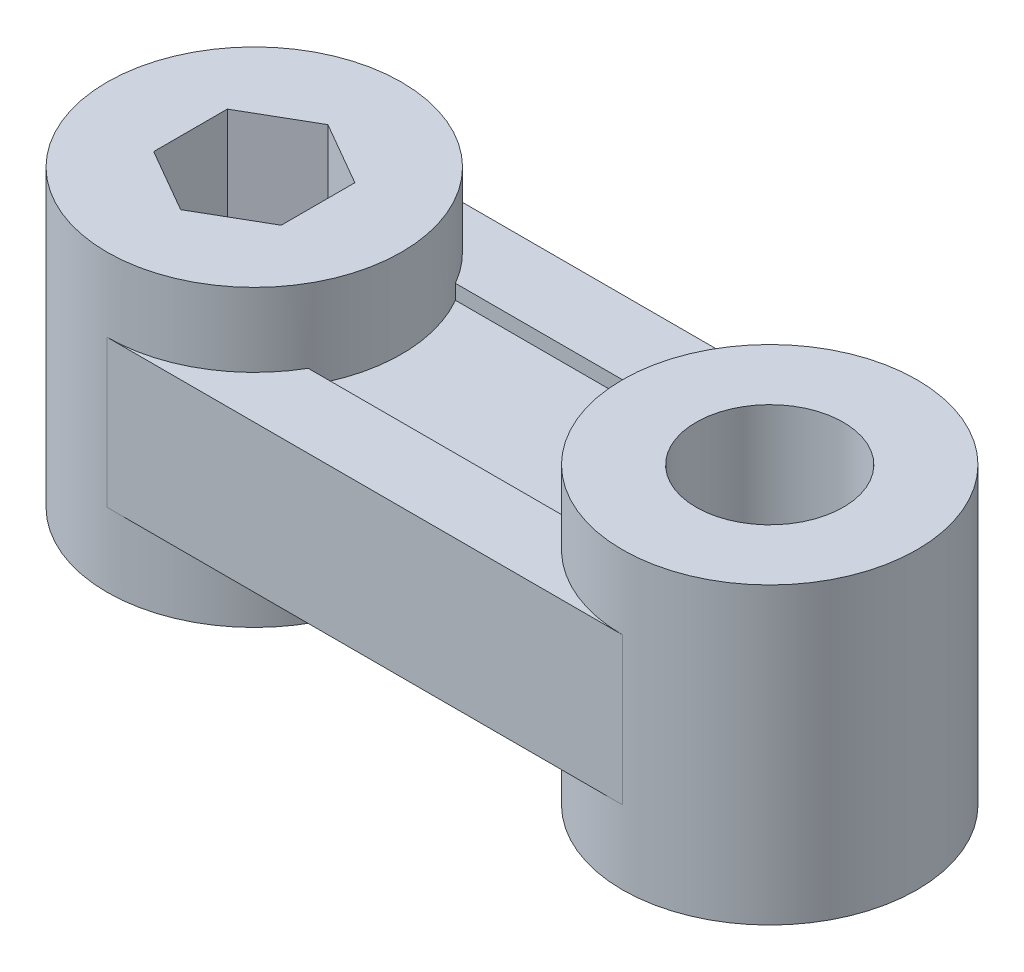
ISO-10303-21;
HEADER;
FILE_DESCRIPTION(('STEP AP214'),'2;1');
FILE_NAME('part.step','',(''),(''),'','','');
FILE_SCHEMA(('AUTOMOTIVE_DESIGN { 1 0 10303 214 1 1 1 1 }'));
ENDSEC;
DATA;
#1=APPLICATION_CONTEXT('core data for automotive mechanical design processes');
#2=APPLICATION_PROTOCOL_DEFINITION('international standard','automotive_design',2000,#1);
#3=PRODUCT_CONTEXT('',#1,'mechanical');
#4=PRODUCT('Part','Part','',(#3));
#5=PRODUCT_RELATED_PRODUCT_CATEGORY('part','',(#4));
#6=PRODUCT_DEFINITION_FORMATION('','',#4);
#7=PRODUCT_DEFINITION_CONTEXT('part definition',#1,'design');
#8=PRODUCT_DEFINITION('design','',#6,#7);
#9=PRODUCT_DEFINITION_SHAPE('','',#8);
#10=(LENGTH_UNIT() NAMED_UNIT(*) SI_UNIT(.MILLI.,.METRE.));
#11=(NAMED_UNIT(*) PLANE_ANGLE_UNIT() SI_UNIT($,.RADIAN.));
#12=(NAMED_UNIT(*) SI_UNIT($,.STERADIAN.) SOLID_ANGLE_UNIT());
#13=UNCERTAINTY_MEASURE_WITH_UNIT(LENGTH_MEASURE(1.E-05),#10,'distance_accuracy_value','');
#14=(GEOMETRIC_REPRESENTATION_CONTEXT(3) GLOBAL_UNCERTAINTY_ASSIGNED_CONTEXT((#13)) GLOBAL_UNIT_ASSIGNED_CONTEXT((#10,
#11,#12)) REPRESENTATION_CONTEXT('',''));
#15=CARTESIAN_POINT('',(0.,0.,0.));
#16=DIRECTION('',(0.,0.,1.));
#17=DIRECTION('',(1.,0.,0.));
#18=AXIS2_PLACEMENT_3D('',#15,#16,#17);
#19=CARTESIAN_POINT('',(0.,5.,0.));
#20=DIRECTION('',(0.,-1.,0.));
#21=DIRECTION('',(0.,0.,-1.));
#22=AXIS2_PLACEMENT_3D('',#19,#20,#21);
#23=PLANE('',#22);
#24=DIRECTION('',(1.,0.,0.));
#25=VECTOR('',#24,1.);
#26=CARTESIAN_POINT('',(0.,5.,-5.00000000000001));
#27=LINE('',#26,#25);
#28=CARTESIAN_POINT('',(8.66025403784439,5.,-5.));
#29=VERTEX_POINT('',#28);
#30=CARTESIAN_POINT('',(26.3397459621556,5.,-5.));
#31=VERTEX_POINT('',#30);
#32=EDGE_CURVE('E180',#29,#31,#27,.T.);
#33=ORIENTED_EDGE('',*,*,#32,.F.);
#34=CARTESIAN_POINT('',(0.,5.,0.));
#35=DIRECTION('',(0.,-1.,0.));
#36=DIRECTION('',(0.,0.,-1.));
#37=AXIS2_PLACEMENT_3D('',#34,#35,#36);
#38=CIRCLE('',#37,10.);
#39=CARTESIAN_POINT('',(0.,5.,-10.));
#40=VERTEX_POINT('',#39);
#41=EDGE_CURVE('E195',#40,#29,#38,.T.);
#42=ORIENTED_EDGE('',*,*,#41,.F.);
#43=DIRECTION('',(1.,0.,0.));
#44=VECTOR('',#43,1.);
#45=CARTESIAN_POINT('',(0.,5.,-10.));
#46=LINE('',#45,#44);
#47=CARTESIAN_POINT('',(35.,5.,-10.));
#48=VERTEX_POINT('',#47);
#49=EDGE_CURVE('E198',#40,#48,#46,.T.);
#50=ORIENTED_EDGE('',*,*,#49,.T.);
#51=CARTESIAN_POINT('',(35.,5.,0.));
#52=DIRECTION('',(0.,-1.,0.));
#53=DIRECTION('',(0.,0.,-1.));
#54=AXIS2_PLACEMENT_3D('',#51,#52,#53);
#55=CIRCLE('',#54,10.);
#56=EDGE_CURVE('E57',#31,#48,#55,.T.);
#57=ORIENTED_EDGE('',*,*,#56,.F.);
#58=EDGE_LOOP('',(#33,#42,#50,#57));
#59=FACE_BOUND('',#58,.T.);
#60=ADVANCED_FACE('F34',(#59),#23,.T.);
#61=CARTESIAN_POINT('',(0.,20.,10.));
#62=DIRECTION('',(0.,0.,-1.));
#63=DIRECTION('',(-1.,0.,0.));
#64=AXIS2_PLACEMENT_3D('',#61,#62,#63);
#65=PLANE('',#64);
#66=DIRECTION('',(-1.,0.,0.));
#67=VECTOR('',#66,1.);
#68=CARTESIAN_POINT('',(0.,5.,10.));
#69=LINE('',#68,#67);
#70=CARTESIAN_POINT('',(35.,5.,10.));
#71=VERTEX_POINT('',#70);
#72=CARTESIAN_POINT('',(0.,5.,10.));
#73=VERTEX_POINT('',#72);
#74=EDGE_CURVE('E201',#71,#73,#69,.T.);
#75=ORIENTED_EDGE('',*,*,#74,.F.);
#76=DIRECTION('',(0.,-1.,0.));
#77=VECTOR('',#76,1.);
#78=CARTESIAN_POINT('',(35.,20.,10.));
#79=LINE('',#78,#77);
#80=CARTESIAN_POINT('',(35.,15.,10.));
#81=VERTEX_POINT('',#80);
#82=EDGE_CURVE('E42',#81,#71,#79,.T.);
#83=ORIENTED_EDGE('',*,*,#82,.F.);
#84=DIRECTION('',(1.,0.,0.));
#85=VECTOR('',#84,1.);
#86=CARTESIAN_POINT('',(35.,15.,10.));
#87=LINE('',#86,#85);
#88=CARTESIAN_POINT('',(0.,15.,10.));
#89=VERTEX_POINT('',#88);
#90=EDGE_CURVE('E234',#89,#81,#87,.T.);
#91=ORIENTED_EDGE('',*,*,#90,.F.);
#92=DIRECTION('',(0.,-1.,0.));
#93=VECTOR('',#92,1.);
#94=CARTESIAN_POINT('',(0.,20.,10.));
#95=LINE('',#94,#93);
#96=EDGE_CURVE('E11',#89,#73,#95,.T.);
#97=ORIENTED_EDGE('',*,*,#96,.T.);
#98=EDGE_LOOP('',(#75,#83,#91,#97));
#99=FACE_BOUND('',#98,.T.);
#100=ADVANCED_FACE('F316',(#99),#65,.F.);
#101=CARTESIAN_POINT('',(0.,20.,-10.));
#102=DIRECTION('',(0.,0.,1.));
#103=DIRECTION('',(1.,0.,0.));
#104=AXIS2_PLACEMENT_3D('',#101,#102,#103);
#105=PLANE('',#104);
#106=ORIENTED_EDGE('',*,*,#49,.F.);
#107=DIRECTION('',(0.,-1.,0.));
#108=VECTOR('',#107,1.);
#109=CARTESIAN_POINT('',(0.,20.,-10.));
#110=LINE('',#109,#108);
#111=CARTESIAN_POINT('',(0.,15.,-10.));
#112=VERTEX_POINT('',#111);
#113=EDGE_CURVE('E303',#112,#40,#110,.T.);
#114=ORIENTED_EDGE('',*,*,#113,.F.);
#115=DIRECTION('',(-1.,0.,0.));
#116=VECTOR('',#115,1.);
#117=CARTESIAN_POINT('',(0.,15.,-10.));
#118=LINE('',#117,#116);
#119=CARTESIAN_POINT('',(35.,15.,-10.));
#120=VERTEX_POINT('',#119);
#121=EDGE_CURVE('E241',#120,#112,#118,.T.);
#122=ORIENTED_EDGE('',*,*,#121,.F.);
#123=DIRECTION('',(0.,-1.,0.));
#124=VECTOR('',#123,1.);
#125=CARTESIAN_POINT('',(35.,20.,-10.));
#126=LINE('',#125,#124);
#127=EDGE_CURVE('E310',#120,#48,#126,.T.);
#128=ORIENTED_EDGE('',*,*,#127,.T.);
#129=EDGE_LOOP('',(#106,#114,#122,#128));
#130=FACE_BOUND('',#129,.T.);
#131=ADVANCED_FACE('F332',(#130),#105,.F.);
#132=CARTESIAN_POINT('',(0.,0.,0.));
#133=DIRECTION('',(0.,1.,0.));
#134=DIRECTION('',(0.,0.,1.));
#135=AXIS2_PLACEMENT_3D('',#132,#133,#134);
#136=PLANE('',#135);
#137=DIRECTION('',(-0.866025403784439,0.,-0.5));
#138=VECTOR('',#137,1.);
#139=CARTESIAN_POINT('',(4.33012701892219,0.,-2.5));
#140=LINE('',#139,#138);
#141=CARTESIAN_POINT('',(4.33012701892219,0.,-2.5));
#142=VERTEX_POINT('',#141);
#143=CARTESIAN_POINT('',(0.,0.,-5.));
#144=VERTEX_POINT('',#143);
#145=EDGE_CURVE('E244',#142,#144,#140,.T.);
#146=ORIENTED_EDGE('',*,*,#145,.T.);
#147=DIRECTION('',(-0.866025403784439,0.,0.5));
#148=VECTOR('',#147,1.);
#149=CARTESIAN_POINT('',(0.,0.,-5.));
#150=LINE('',#149,#148);
#151=CARTESIAN_POINT('',(-4.33012701892219,0.,-2.5));
#152=VERTEX_POINT('',#151);
#153=EDGE_CURVE('E262',#144,#152,#150,.T.);
#154=ORIENTED_EDGE('',*,*,#153,.T.);
#155=DIRECTION('',(0.,0.,1.));
#156=VECTOR('',#155,1.);
#157=CARTESIAN_POINT('',(-4.33012701892219,0.,-2.5));
#158=LINE('',#157,#156);
#159=CARTESIAN_POINT('',(-4.33012701892219,0.,2.5));
#160=VERTEX_POINT('',#159);
#161=EDGE_CURVE('E265',#152,#160,#158,.T.);
#162=ORIENTED_EDGE('',*,*,#161,.T.);
#163=DIRECTION('',(0.866025403784439,0.,0.5));
#164=VECTOR('',#163,1.);
#165=CARTESIAN_POINT('',(-4.33012701892219,0.,2.5));
#166=LINE('',#165,#164);
#167=CARTESIAN_POINT('',(0.,0.,5.));
#168=VERTEX_POINT('',#167);
#169=EDGE_CURVE('E268',#160,#168,#166,.T.);
#170=ORIENTED_EDGE('',*,*,#169,.T.);
#171=DIRECTION('',(0.866025403784439,0.,-0.5));
#172=VECTOR('',#171,1.);
#173=CARTESIAN_POINT('',(0.,0.,5.));
#174=LINE('',#173,#172);
#175=CARTESIAN_POINT('',(4.33012701892219,0.,2.5));
#176=VERTEX_POINT('',#175);
#177=EDGE_CURVE('E271',#168,#176,#174,.T.);
#178=ORIENTED_EDGE('',*,*,#177,.T.);
#179=DIRECTION('',(0.,0.,-1.));
#180=VECTOR('',#179,1.);
#181=CARTESIAN_POINT('',(4.33012701892219,0.,2.5));
#182=LINE('',#181,#180);
#183=EDGE_CURVE('E248',#176,#142,#182,.T.);
#184=ORIENTED_EDGE('',*,*,#183,.T.);
#185=EDGE_LOOP('',(#146,#154,#162,#170,#178,#184));
#186=FACE_BOUND('',#185,.T.);
#187=CARTESIAN_POINT('',(0.,0.,0.));
#188=DIRECTION('',(0.,1.,0.));
#189=DIRECTION('',(0.,0.,1.));
#190=AXIS2_PLACEMENT_3D('',#187,#188,#189);
#191=CIRCLE('',#190,10.);
#192=CARTESIAN_POINT('',(0.,0.,10.));
#193=VERTEX_POINT('',#192);
#194=EDGE_CURVE('E293',#193,#193,#191,.T.);
#195=ORIENTED_EDGE('',*,*,#194,.F.);
#196=EDGE_LOOP('',(#195));
#197=FACE_BOUND('',#196,.T.);
#198=ADVANCED_FACE('F361',(#186,#197),#136,.F.);
#199=CARTESIAN_POINT('',(35.,0.,0.));
#200=DIRECTION('',(0.,1.,0.));
#201=DIRECTION('',(0.,0.,1.));
#202=AXIS2_PLACEMENT_3D('',#199,#200,#201);
#203=CIRCLE('',#202,5.);
#204=CARTESIAN_POINT('',(35.,0.,5.));
#205=VERTEX_POINT('',#204);
#206=EDGE_CURVE('E289',#205,#205,#203,.T.);
#207=ORIENTED_EDGE('',*,*,#206,.T.);
#208=EDGE_LOOP('',(#207));
#209=FACE_BOUND('',#208,.T.);
#210=CARTESIAN_POINT('',(35.,0.,0.));
#211=DIRECTION('',(0.,1.,0.));
#212=DIRECTION('',(0.,0.,1.));
#213=AXIS2_PLACEMENT_3D('',#210,#211,#212);
#214=CIRCLE('',#213,10.);
#215=CARTESIAN_POINT('',(35.,0.,10.));
#216=VERTEX_POINT('',#215);
#217=EDGE_CURVE('E300',#216,#216,#214,.T.);
#218=ORIENTED_EDGE('',*,*,#217,.F.);
#219=EDGE_LOOP('',(#218));
#220=FACE_BOUND('',#219,.T.);
#221=ADVANCED_FACE('F352',(#209,#220),#136,.F.);
#222=CARTESIAN_POINT('',(0.,15.,0.));
#223=DIRECTION('',(0.,1.,0.));
#224=DIRECTION('',(0.,0.,1.));
#225=AXIS2_PLACEMENT_3D('',#222,#223,#224);
#226=PLANE('',#225);
#227=DIRECTION('',(1.,0.,0.));
#228=VECTOR('',#227,1.);
#229=CARTESIAN_POINT('',(8.66025403784439,15.,5.));
#230=LINE('',#229,#228);
#231=CARTESIAN_POINT('',(8.66025403784439,15.,5.));
#232=VERTEX_POINT('',#231);
#233=CARTESIAN_POINT('',(26.3397459621556,15.,5.));
#234=VERTEX_POINT('',#233);
#235=EDGE_CURVE('E209',#232,#234,#230,.T.);
#236=ORIENTED_EDGE('',*,*,#235,.F.);
#237=CARTESIAN_POINT('',(0.,15.,0.));
#238=DIRECTION('',(0.,-1.,0.));
#239=DIRECTION('',(0.,0.,1.));
#240=AXIS2_PLACEMENT_3D('',#237,#238,#239);
#241=CIRCLE('',#240,10.);
#242=EDGE_CURVE('E225',#232,#89,#241,.T.);
#243=ORIENTED_EDGE('',*,*,#242,.T.);
#244=ORIENTED_EDGE('',*,*,#90,.T.);
#245=CARTESIAN_POINT('',(35.,15.,0.));
#246=DIRECTION('',(0.,-1.,0.));
#247=DIRECTION('',(0.,0.,1.));
#248=AXIS2_PLACEMENT_3D('',#245,#246,#247);
#249=CIRCLE('',#248,10.);
#250=EDGE_CURVE('E238',#81,#234,#249,.T.);
#251=ORIENTED_EDGE('',*,*,#250,.T.);
#252=EDGE_LOOP('',(#236,#243,#244,#251));
#253=FACE_BOUND('',#252,.T.);
#254=ADVANCED_FACE('F349',(#253),#226,.T.);
#255=CARTESIAN_POINT('',(0.,20.,0.));
#256=DIRECTION('',(0.,1.,0.));
#257=DIRECTION('',(0.,0.,1.));
#258=AXIS2_PLACEMENT_3D('',#255,#256,#257);
#259=PLANE('',#258);
#260=CARTESIAN_POINT('',(0.,20.,0.));
#261=DIRECTION('',(0.,1.,0.));
#262=DIRECTION('',(0.,0.,1.));
#263=AXIS2_PLACEMENT_3D('',#260,#261,#262);
#264=CIRCLE('',#263,10.);
#265=CARTESIAN_POINT('',(0.,20.,10.));
#266=VERTEX_POINT('',#265);
#267=EDGE_CURVE('E296',#266,#266,#264,.T.);
#268=ORIENTED_EDGE('',*,*,#267,.T.);
#269=EDGE_LOOP('',(#268));
#270=FACE_BOUND('',#269,.T.);
#271=DIRECTION('',(-0.866025403784439,0.,0.5));
#272=VECTOR('',#271,1.);
#273=CARTESIAN_POINT('',(0.,20.,-5.));
#274=LINE('',#273,#272);
#275=CARTESIAN_POINT('',(0.,20.,-5.));
#276=VERTEX_POINT('',#275);
#277=CARTESIAN_POINT('',(-4.33012701892219,20.,-2.5));
#278=VERTEX_POINT('',#277);
#279=EDGE_CURVE('E247',#276,#278,#274,.T.);
#280=ORIENTED_EDGE('',*,*,#279,.F.);
#281=DIRECTION('',(-0.866025403784439,0.,-0.5));
#282=VECTOR('',#281,1.);
#283=CARTESIAN_POINT('',(4.33012701892219,20.,-2.5));
#284=LINE('',#283,#282);
#285=CARTESIAN_POINT('',(4.33012701892219,20.,-2.5));
#286=VERTEX_POINT('',#285);
#287=EDGE_CURVE('E245',#286,#276,#284,.T.);
#288=ORIENTED_EDGE('',*,*,#287,.F.);
#289=DIRECTION('',(0.,0.,-1.));
#290=VECTOR('',#289,1.);
#291=CARTESIAN_POINT('',(4.33012701892219,20.,2.5));
#292=LINE('',#291,#290);
#293=CARTESIAN_POINT('',(4.33012701892219,20.,2.5));
#294=VERTEX_POINT('',#293);
#295=EDGE_CURVE('E257',#294,#286,#292,.T.);
#296=ORIENTED_EDGE('',*,*,#295,.F.);
#297=DIRECTION('',(0.866025403784439,0.,-0.5));
#298=VECTOR('',#297,1.);
#299=CARTESIAN_POINT('',(0.,20.,5.));
#300=LINE('',#299,#298);
#301=CARTESIAN_POINT('',(0.,20.,5.));
#302=VERTEX_POINT('',#301);
#303=EDGE_CURVE('E254',#302,#294,#300,.T.);
#304=ORIENTED_EDGE('',*,*,#303,.F.);
#305=DIRECTION('',(0.866025403784439,0.,0.5));
#306=VECTOR('',#305,1.);
#307=CARTESIAN_POINT('',(-4.33012701892219,20.,2.5));
#308=LINE('',#307,#306);
#309=CARTESIAN_POINT('',(-4.33012701892219,20.,2.5));
#310=VERTEX_POINT('',#309);
#311=EDGE_CURVE('E252',#310,#302,#308,.T.);
#312=ORIENTED_EDGE('',*,*,#311,.F.);
#313=DIRECTION('',(0.,0.,1.));
#314=VECTOR('',#313,1.);
#315=CARTESIAN_POINT('',(-4.33012701892219,20.,-2.5));
#316=LINE('',#315,#314);
#317=EDGE_CURVE('E250',#278,#310,#316,.T.);
#318=ORIENTED_EDGE('',*,*,#317,.F.);
#319=EDGE_LOOP('',(#280,#288,#296,#304,#312,#318));
#320=FACE_BOUND('',#319,.T.);
#321=ADVANCED_FACE('F351',(#270,#320),#259,.T.);
#322=CARTESIAN_POINT('',(35.,20.,0.));
#323=DIRECTION('',(0.,1.,0.));
#324=DIRECTION('',(0.,0.,1.));
#325=AXIS2_PLACEMENT_3D('',#322,#323,#324);
#326=CIRCLE('',#325,10.);
#327=CARTESIAN_POINT('',(35.,20.,10.));
#328=VERTEX_POINT('',#327);
#329=EDGE_CURVE('E299',#328,#328,#326,.T.);
#330=ORIENTED_EDGE('',*,*,#329,.T.);
#331=EDGE_LOOP('',(#330));
#332=FACE_BOUND('',#331,.T.);
#333=CARTESIAN_POINT('',(35.,20.,0.));
#334=DIRECTION('',(0.,1.,0.));
#335=DIRECTION('',(0.,0.,1.));
#336=AXIS2_PLACEMENT_3D('',#333,#334,#335);
#337=CIRCLE('',#336,5.);
#338=CARTESIAN_POINT('',(35.,20.,5.));
#339=VERTEX_POINT('',#338);
#340=EDGE_CURVE('E290',#339,#339,#337,.T.);
#341=ORIENTED_EDGE('',*,*,#340,.F.);
#342=EDGE_LOOP('',(#341));
#343=FACE_BOUND('',#342,.T.);
#344=ADVANCED_FACE('F358',(#332,#343),#259,.T.);
#345=CARTESIAN_POINT('',(0.,20.,0.));
#346=DIRECTION('',(0.,-1.,0.));
#347=DIRECTION('',(0.,0.,-1.));
#348=AXIS2_PLACEMENT_3D('',#345,#346,#347);
#349=CYLINDRICAL_SURFACE('',#348,10.);
#350=ORIENTED_EDGE('',*,*,#194,.T.);
#351=EDGE_LOOP('',(#350));
#352=FACE_BOUND('',#351,.T.);
#353=ORIENTED_EDGE('',*,*,#96,.F.);
#354=ORIENTED_EDGE('',*,*,#242,.F.);
#355=DIRECTION('',(0.,1.,0.));
#356=VECTOR('',#355,1.);
#357=CARTESIAN_POINT('',(8.66025403784439,14.,5.));
#358=LINE('',#357,#356);
#359=CARTESIAN_POINT('',(8.66025403784439,14.,5.));
#360=VERTEX_POINT('',#359);
#361=EDGE_CURVE('E226',#360,#232,#358,.T.);
#362=ORIENTED_EDGE('',*,*,#361,.F.);
#363=CARTESIAN_POINT('',(0.,14.,0.));
#364=DIRECTION('',(0.,-1.,0.));
#365=DIRECTION('',(0.,0.,1.));
#366=AXIS2_PLACEMENT_3D('',#363,#364,#365);
#367=CIRCLE('',#366,10.);
#368=CARTESIAN_POINT('',(8.66025403784439,14.,-5.));
#369=VERTEX_POINT('',#368);
#370=EDGE_CURVE('E212',#369,#360,#367,.T.);
#371=ORIENTED_EDGE('',*,*,#370,.F.);
#372=DIRECTION('',(0.,1.,0.));
#373=VECTOR('',#372,1.);
#374=CARTESIAN_POINT('',(8.66025403784439,14.,-5.));
#375=LINE('',#374,#373);
#376=CARTESIAN_POINT('',(8.66025403784439,15.,-5.));
#377=VERTEX_POINT('',#376);
#378=EDGE_CURVE('E228',#369,#377,#375,.T.);
#379=ORIENTED_EDGE('',*,*,#378,.T.);
#380=EDGE_CURVE('E231',#112,#377,#241,.T.);
#381=ORIENTED_EDGE('',*,*,#380,.F.);
#382=ORIENTED_EDGE('',*,*,#113,.T.);
#383=ORIENTED_EDGE('',*,*,#41,.T.);
#384=DIRECTION('',(0.,-1.,0.));
#385=VECTOR('',#384,1.);
#386=CARTESIAN_POINT('',(8.66025403784439,6.,-5.));
#387=LINE('',#386,#385);
#388=CARTESIAN_POINT('',(8.66025403784439,6.,-5.));
#389=VERTEX_POINT('',#388);
#390=EDGE_CURVE('E192',#389,#29,#387,.T.);
#391=ORIENTED_EDGE('',*,*,#390,.F.);
#392=CARTESIAN_POINT('',(0.,6.,0.));
#393=DIRECTION('',(0.,-1.,0.));
#394=DIRECTION('',(0.,0.,-1.));
#395=AXIS2_PLACEMENT_3D('',#392,#393,#394);
#396=CIRCLE('',#395,10.);
#397=CARTESIAN_POINT('',(8.66025403784439,6.,5.));
#398=VERTEX_POINT('',#397);
#399=EDGE_CURVE('E176',#398,#389,#396,.F.);
#400=ORIENTED_EDGE('',*,*,#399,.F.);
#401=DIRECTION('',(0.,-1.,0.));
#402=VECTOR('',#401,1.);
#403=CARTESIAN_POINT('',(8.66025403784439,6.,5.));
#404=LINE('',#403,#402);
#405=CARTESIAN_POINT('',(8.66025403784439,5.,5.));
#406=VERTEX_POINT('',#405);
#407=EDGE_CURVE('E167',#398,#406,#404,.T.);
#408=ORIENTED_EDGE('',*,*,#407,.T.);
#409=EDGE_CURVE('E191',#406,#73,#38,.T.);
#410=ORIENTED_EDGE('',*,*,#409,.T.);
#411=EDGE_LOOP('',(#353,#354,#362,#371,#379,#381,#382,#383,#391,#400,#408,#410));
#412=FACE_BOUND('',#411,.T.);
#413=ORIENTED_EDGE('',*,*,#267,.F.);
#414=EDGE_LOOP('',(#413));
#415=FACE_BOUND('',#414,.T.);
#416=ADVANCED_FACE('F36',(#352,#412,#415),#349,.T.);
#417=CARTESIAN_POINT('',(35.,20.,0.));
#418=DIRECTION('',(0.,-1.,0.));
#419=DIRECTION('',(0.,0.,-1.));
#420=AXIS2_PLACEMENT_3D('',#417,#418,#419);
#421=CYLINDRICAL_SURFACE('',#420,10.);
#422=ORIENTED_EDGE('',*,*,#217,.T.);
#423=EDGE_LOOP('',(#422));
#424=FACE_BOUND('',#423,.T.);
#425=ORIENTED_EDGE('',*,*,#250,.F.);
#426=ORIENTED_EDGE('',*,*,#82,.T.);
#427=CARTESIAN_POINT('',(26.3397459621556,5.,5.));
#428=VERTEX_POINT('',#427);
#429=EDGE_CURVE('E166',#71,#428,#55,.T.);
#430=ORIENTED_EDGE('',*,*,#429,.T.);
#431=DIRECTION('',(0.,-1.,0.));
#432=VECTOR('',#431,1.);
#433=CARTESIAN_POINT('',(26.3397459621556,6.,5.));
#434=LINE('',#433,#432);
#435=CARTESIAN_POINT('',(26.3397459621556,6.,5.));
#436=VERTEX_POINT('',#435);
#437=EDGE_CURVE('E49',#436,#428,#434,.T.);
#438=ORIENTED_EDGE('',*,*,#437,.F.);
#439=CARTESIAN_POINT('',(35.,6.,0.));
#440=DIRECTION('',(0.,-1.,0.));
#441=DIRECTION('',(0.,0.,-1.));
#442=AXIS2_PLACEMENT_3D('',#439,#440,#441);
#443=CIRCLE('',#442,10.);
#444=CARTESIAN_POINT('',(26.3397459621556,6.,-5.));
#445=VERTEX_POINT('',#444);
#446=EDGE_CURVE('E163',#445,#436,#443,.F.);
#447=ORIENTED_EDGE('',*,*,#446,.F.);
#448=DIRECTION('',(0.,-1.,0.));
#449=VECTOR('',#448,1.);
#450=CARTESIAN_POINT('',(26.3397459621556,6.,-5.));
#451=LINE('',#450,#449);
#452=EDGE_CURVE('E189',#445,#31,#451,.T.);
#453=ORIENTED_EDGE('',*,*,#452,.T.);
#454=ORIENTED_EDGE('',*,*,#56,.T.);
#455=ORIENTED_EDGE('',*,*,#127,.F.);
#456=CARTESIAN_POINT('',(26.3397459621556,15.,-5.));
#457=VERTEX_POINT('',#456);
#458=EDGE_CURVE('E237',#457,#120,#249,.T.);
#459=ORIENTED_EDGE('',*,*,#458,.F.);
#460=DIRECTION('',(0.,1.,0.));
#461=VECTOR('',#460,1.);
#462=CARTESIAN_POINT('',(26.3397459621556,14.,-5.));
#463=LINE('',#462,#461);
#464=CARTESIAN_POINT('',(26.3397459621556,14.,-5.));
#465=VERTEX_POINT('',#464);
#466=EDGE_CURVE('E218',#465,#457,#463,.T.);
#467=ORIENTED_EDGE('',*,*,#466,.F.);
#468=CARTESIAN_POINT('',(35.,14.,0.));
#469=DIRECTION('',(0.,-1.,0.));
#470=DIRECTION('',(0.,0.,1.));
#471=AXIS2_PLACEMENT_3D('',#468,#469,#470);
#472=CIRCLE('',#471,10.);
#473=CARTESIAN_POINT('',(26.3397459621556,14.,5.));
#474=VERTEX_POINT('',#473);
#475=EDGE_CURVE('E205',#474,#465,#472,.T.);
#476=ORIENTED_EDGE('',*,*,#475,.F.);
#477=DIRECTION('',(0.,1.,0.));
#478=VECTOR('',#477,1.);
#479=CARTESIAN_POINT('',(26.3397459621556,14.,5.));
#480=LINE('',#479,#478);
#481=EDGE_CURVE('E223',#474,#234,#480,.T.);
#482=ORIENTED_EDGE('',*,*,#481,.T.);
#483=EDGE_LOOP('',(#425,#426,#430,#438,#447,#453,#454,#455,#459,#467,#476,#482));
#484=FACE_BOUND('',#483,.T.);
#485=ORIENTED_EDGE('',*,*,#329,.F.);
#486=EDGE_LOOP('',(#485));
#487=FACE_BOUND('',#486,.T.);
#488=ADVANCED_FACE('F160',(#424,#484,#487),#421,.T.);
#489=CARTESIAN_POINT('',(35.,20.,0.));
#490=DIRECTION('',(0.,-1.,0.));
#491=DIRECTION('',(0.,0.,-1.));
#492=AXIS2_PLACEMENT_3D('',#489,#490,#491);
#493=CYLINDRICAL_SURFACE('',#492,5.);
#494=ORIENTED_EDGE('',*,*,#340,.T.);
#495=EDGE_LOOP('',(#494));
#496=FACE_BOUND('',#495,.T.);
#497=ORIENTED_EDGE('',*,*,#206,.F.);
#498=EDGE_LOOP('',(#497));
#499=FACE_BOUND('',#498,.T.);
#500=ADVANCED_FACE('F453',(#496,#499),#493,.F.);
#501=CARTESIAN_POINT('',(4.33012701892219,20.,-2.5));
#502=DIRECTION('',(-0.5,0.,0.866025403784439));
#503=DIRECTION('',(0.866025403784439,0.,0.5));
#504=AXIS2_PLACEMENT_3D('',#501,#502,#503);
#505=PLANE('',#504);
#506=ORIENTED_EDGE('',*,*,#145,.F.);
#507=DIRECTION('',(0.,-1.,0.));
#508=VECTOR('',#507,1.);
#509=CARTESIAN_POINT('',(4.33012701892219,20.,-2.5));
#510=LINE('',#509,#508);
#511=EDGE_CURVE('E259',#286,#142,#510,.T.);
#512=ORIENTED_EDGE('',*,*,#511,.F.);
#513=ORIENTED_EDGE('',*,*,#287,.T.);
#514=DIRECTION('',(0.,-1.,0.));
#515=VECTOR('',#514,1.);
#516=CARTESIAN_POINT('',(0.,20.,-5.));
#517=LINE('',#516,#515);
#518=EDGE_CURVE('E286',#276,#144,#517,.T.);
#519=ORIENTED_EDGE('',*,*,#518,.T.);
#520=EDGE_LOOP('',(#506,#512,#513,#519));
#521=FACE_BOUND('',#520,.T.);
#522=ADVANCED_FACE('F550',(#521),#505,.T.);
#523=CARTESIAN_POINT('',(0.,20.,-5.));
#524=DIRECTION('',(0.5,0.,0.866025403784439));
#525=DIRECTION('',(0.866025403784439,0.,-0.5));
#526=AXIS2_PLACEMENT_3D('',#523,#524,#525);
#527=PLANE('',#526);
#528=ORIENTED_EDGE('',*,*,#153,.F.);
#529=ORIENTED_EDGE('',*,*,#518,.F.);
#530=ORIENTED_EDGE('',*,*,#279,.T.);
#531=DIRECTION('',(0.,-1.,0.));
#532=VECTOR('',#531,1.);
#533=CARTESIAN_POINT('',(-4.33012701892219,20.,-2.5));
#534=LINE('',#533,#532);
#535=EDGE_CURVE('E284',#278,#152,#534,.T.);
#536=ORIENTED_EDGE('',*,*,#535,.T.);
#537=EDGE_LOOP('',(#528,#529,#530,#536));
#538=FACE_BOUND('',#537,.T.);
#539=ADVANCED_FACE('F559',(#538),#527,.T.);
#540=CARTESIAN_POINT('',(-4.33012701892219,20.,-2.5));
#541=DIRECTION('',(1.,0.,0.));
#542=DIRECTION('',(0.,0.,-1.));
#543=AXIS2_PLACEMENT_3D('',#540,#541,#542);
#544=PLANE('',#543);
#545=ORIENTED_EDGE('',*,*,#161,.F.);
#546=ORIENTED_EDGE('',*,*,#535,.F.);
#547=ORIENTED_EDGE('',*,*,#317,.T.);
#548=DIRECTION('',(0.,-1.,0.));
#549=VECTOR('',#548,1.);
#550=CARTESIAN_POINT('',(-4.33012701892219,20.,2.5));
#551=LINE('',#550,#549);
#552=EDGE_CURVE('E282',#310,#160,#551,.T.);
#553=ORIENTED_EDGE('',*,*,#552,.T.);
#554=EDGE_LOOP('',(#545,#546,#547,#553));
#555=FACE_BOUND('',#554,.T.);
#556=ADVANCED_FACE('F568',(#555),#544,.T.);
#557=CARTESIAN_POINT('',(-4.33012701892219,20.,2.5));
#558=DIRECTION('',(0.5,0.,-0.866025403784439));
#559=DIRECTION('',(-0.866025403784439,0.,-0.5));
#560=AXIS2_PLACEMENT_3D('',#557,#558,#559);
#561=PLANE('',#560);
#562=ORIENTED_EDGE('',*,*,#169,.F.);
#563=ORIENTED_EDGE('',*,*,#552,.F.);
#564=ORIENTED_EDGE('',*,*,#311,.T.);
#565=DIRECTION('',(0.,-1.,0.));
#566=VECTOR('',#565,1.);
#567=CARTESIAN_POINT('',(0.,20.,5.));
#568=LINE('',#567,#566);
#569=EDGE_CURVE('E280',#302,#168,#568,.T.);
#570=ORIENTED_EDGE('',*,*,#569,.T.);
#571=EDGE_LOOP('',(#562,#563,#564,#570));
#572=FACE_BOUND('',#571,.T.);
#573=ADVANCED_FACE('F577',(#572),#561,.T.);
#574=CARTESIAN_POINT('',(0.,20.,5.));
#575=DIRECTION('',(-0.5,0.,-0.866025403784439));
#576=DIRECTION('',(-0.866025403784439,0.,0.5));
#577=AXIS2_PLACEMENT_3D('',#574,#575,#576);
#578=PLANE('',#577);
#579=ORIENTED_EDGE('',*,*,#177,.F.);
#580=ORIENTED_EDGE('',*,*,#569,.F.);
#581=ORIENTED_EDGE('',*,*,#303,.T.);
#582=DIRECTION('',(0.,-1.,0.));
#583=VECTOR('',#582,1.);
#584=CARTESIAN_POINT('',(4.33012701892219,20.,2.5));
#585=LINE('',#584,#583);
#586=EDGE_CURVE('E278',#294,#176,#585,.T.);
#587=ORIENTED_EDGE('',*,*,#586,.T.);
#588=EDGE_LOOP('',(#579,#580,#581,#587));
#589=FACE_BOUND('',#588,.T.);
#590=ADVANCED_FACE('F586',(#589),#578,.T.);
#591=CARTESIAN_POINT('',(4.33012701892219,20.,2.5));
#592=DIRECTION('',(-1.,0.,0.));
#593=DIRECTION('',(0.,0.,1.));
#594=AXIS2_PLACEMENT_3D('',#591,#592,#593);
#595=PLANE('',#594);
#596=ORIENTED_EDGE('',*,*,#183,.F.);
#597=ORIENTED_EDGE('',*,*,#586,.F.);
#598=ORIENTED_EDGE('',*,*,#295,.T.);
#599=ORIENTED_EDGE('',*,*,#511,.T.);
#600=EDGE_LOOP('',(#596,#597,#598,#599));
#601=FACE_BOUND('',#600,.T.);
#602=ADVANCED_FACE('F367',(#601),#595,.T.);
#603=DIRECTION('',(-1.,0.,0.));
#604=VECTOR('',#603,1.);
#605=CARTESIAN_POINT('',(26.3397459621556,15.,-5.));
#606=LINE('',#605,#604);
#607=EDGE_CURVE('E204',#457,#377,#606,.T.);
#608=ORIENTED_EDGE('',*,*,#607,.F.);
#609=ORIENTED_EDGE('',*,*,#458,.T.);
#610=ORIENTED_EDGE('',*,*,#121,.T.);
#611=ORIENTED_EDGE('',*,*,#380,.T.);
#612=EDGE_LOOP('',(#608,#609,#610,#611));
#613=FACE_BOUND('',#612,.T.);
#614=ADVANCED_FACE('F338',(#613),#226,.T.);
#615=CARTESIAN_POINT('',(8.66025403784439,14.,5.));
#616=DIRECTION('',(0.,0.,1.));
#617=DIRECTION('',(1.,0.,0.));
#618=AXIS2_PLACEMENT_3D('',#615,#616,#617);
#619=PLANE('',#618);
#620=ORIENTED_EDGE('',*,*,#235,.T.);
#621=ORIENTED_EDGE('',*,*,#481,.F.);
#622=DIRECTION('',(1.,0.,0.));
#623=VECTOR('',#622,1.);
#624=CARTESIAN_POINT('',(8.66025403784439,14.,5.));
#625=LINE('',#624,#623);
#626=EDGE_CURVE('E215',#360,#474,#625,.T.);
#627=ORIENTED_EDGE('',*,*,#626,.F.);
#628=ORIENTED_EDGE('',*,*,#361,.T.);
#629=EDGE_LOOP('',(#620,#621,#627,#628));
#630=FACE_BOUND('',#629,.T.);
#631=ADVANCED_FACE('F347',(#630),#619,.F.);
#632=CARTESIAN_POINT('',(26.3397459621556,14.,-5.));
#633=DIRECTION('',(0.,0.,-1.));
#634=DIRECTION('',(-1.,0.,0.));
#635=AXIS2_PLACEMENT_3D('',#632,#633,#634);
#636=PLANE('',#635);
#637=ORIENTED_EDGE('',*,*,#607,.T.);
#638=ORIENTED_EDGE('',*,*,#378,.F.);
#639=DIRECTION('',(-1.,0.,0.));
#640=VECTOR('',#639,1.);
#641=CARTESIAN_POINT('',(26.3397459621556,14.,-5.));
#642=LINE('',#641,#640);
#643=EDGE_CURVE('E208',#465,#369,#642,.T.);
#644=ORIENTED_EDGE('',*,*,#643,.F.);
#645=ORIENTED_EDGE('',*,*,#466,.T.);
#646=EDGE_LOOP('',(#637,#638,#644,#645));
#647=FACE_BOUND('',#646,.T.);
#648=ADVANCED_FACE('F340',(#647),#636,.F.);
#649=CARTESIAN_POINT('',(35.,14.,0.));
#650=DIRECTION('',(0.,1.,0.));
#651=DIRECTION('',(0.,0.,1.));
#652=AXIS2_PLACEMENT_3D('',#649,#650,#651);
#653=PLANE('',#652);
#654=ORIENTED_EDGE('',*,*,#475,.T.);
#655=ORIENTED_EDGE('',*,*,#643,.T.);
#656=ORIENTED_EDGE('',*,*,#370,.T.);
#657=ORIENTED_EDGE('',*,*,#626,.T.);
#658=EDGE_LOOP('',(#654,#655,#656,#657));
#659=FACE_BOUND('',#658,.T.);
#660=ADVANCED_FACE('F343',(#659),#653,.T.);
#661=DIRECTION('',(-1.,0.,0.));
#662=VECTOR('',#661,1.);
#663=CARTESIAN_POINT('',(0.,5.,5.00000000000001));
#664=LINE('',#663,#662);
#665=EDGE_CURVE('E183',#428,#406,#664,.T.);
#666=ORIENTED_EDGE('',*,*,#665,.F.);
#667=ORIENTED_EDGE('',*,*,#429,.F.);
#668=ORIENTED_EDGE('',*,*,#74,.T.);
#669=ORIENTED_EDGE('',*,*,#409,.F.);
#670=EDGE_LOOP('',(#666,#667,#668,#669));
#671=FACE_BOUND('',#670,.T.);
#672=ADVANCED_FACE('F320',(#671),#23,.T.);
#673=CARTESIAN_POINT('',(0.,6.,-5.00000000000001));
#674=DIRECTION('',(0.,0.,-1.));
#675=DIRECTION('',(-1.,0.,0.));
#676=AXIS2_PLACEMENT_3D('',#673,#674,#675);
#677=PLANE('',#676);
#678=ORIENTED_EDGE('',*,*,#32,.T.);
#679=ORIENTED_EDGE('',*,*,#452,.F.);
#680=DIRECTION('',(1.,0.,0.));
#681=VECTOR('',#680,1.);
#682=CARTESIAN_POINT('',(0.,6.,-5.00000000000001));
#683=LINE('',#682,#681);
#684=EDGE_CURVE('E168',#389,#445,#683,.T.);
#685=ORIENTED_EDGE('',*,*,#684,.F.);
#686=ORIENTED_EDGE('',*,*,#390,.T.);
#687=EDGE_LOOP('',(#678,#679,#685,#686));
#688=FACE_BOUND('',#687,.T.);
#689=ADVANCED_FACE('F325',(#688),#677,.F.);
#690=CARTESIAN_POINT('',(0.,6.,5.00000000000001));
#691=DIRECTION('',(0.,0.,1.));
#692=DIRECTION('',(1.,0.,0.));
#693=AXIS2_PLACEMENT_3D('',#690,#691,#692);
#694=PLANE('',#693);
#695=ORIENTED_EDGE('',*,*,#665,.T.);
#696=ORIENTED_EDGE('',*,*,#407,.F.);
#697=DIRECTION('',(-1.,0.,0.));
#698=VECTOR('',#697,1.);
#699=CARTESIAN_POINT('',(0.,6.,5.00000000000001));
#700=LINE('',#699,#698);
#701=EDGE_CURVE('E171',#436,#398,#700,.T.);
#702=ORIENTED_EDGE('',*,*,#701,.F.);
#703=ORIENTED_EDGE('',*,*,#437,.T.);
#704=EDGE_LOOP('',(#695,#696,#702,#703));
#705=FACE_BOUND('',#704,.T.);
#706=ADVANCED_FACE('F172',(#705),#694,.F.);
#707=CARTESIAN_POINT('',(0.,6.,0.));
#708=DIRECTION('',(0.,-1.,0.));
#709=DIRECTION('',(0.,0.,-1.));
#710=AXIS2_PLACEMENT_3D('',#707,#708,#709);
#711=PLANE('',#710);
#712=ORIENTED_EDGE('',*,*,#446,.T.);
#713=ORIENTED_EDGE('',*,*,#701,.T.);
#714=ORIENTED_EDGE('',*,*,#399,.T.);
#715=ORIENTED_EDGE('',*,*,#684,.T.);
#716=EDGE_LOOP('',(#712,#713,#714,#715));
#717=FACE_BOUND('',#716,.T.);
#718=ADVANCED_FACE('F178',(#717),#711,.T.);
#719=CLOSED_SHELL('',(#60,#100,#131,#198,#221,#254,#321,#344,#416,#488,#500,#522,#539,#556,#573,
#590,#602,#614,#631,#648,#660,#672,#689,#706,#718));
#720=MANIFOLD_SOLID_BREP('B2',#719);
#721=ADVANCED_BREP_SHAPE_REPRESENTATION('',(#18,#720),#14);
#722=SHAPE_DEFINITION_REPRESENTATION(#9,#721);
ENDSEC;
END-ISO-10303-21;
